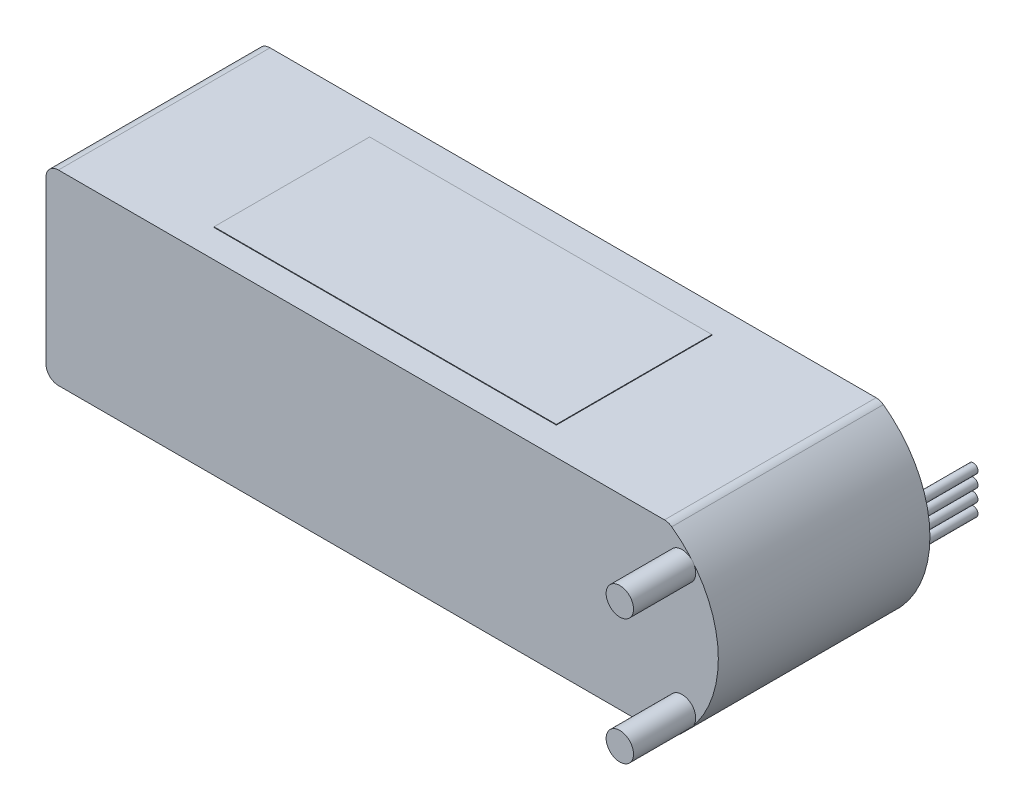
ISO-10303-21;
HEADER;
FILE_DESCRIPTION(('STEP AP214'),'2;1');
FILE_NAME('part.step','',(''),(''),'','','');
FILE_SCHEMA(('AUTOMOTIVE_DESIGN { 1 0 10303 214 1 1 1 1 }'));
ENDSEC;
DATA;
#1=APPLICATION_CONTEXT('core data for automotive mechanical design processes');
#2=APPLICATION_PROTOCOL_DEFINITION('international standard','automotive_design',2000,#1);
#3=PRODUCT_CONTEXT('',#1,'mechanical');
#4=PRODUCT('Part','Part','',(#3));
#5=PRODUCT_RELATED_PRODUCT_CATEGORY('part','',(#4));
#6=PRODUCT_DEFINITION_FORMATION('','',#4);
#7=PRODUCT_DEFINITION_CONTEXT('part definition',#1,'design');
#8=PRODUCT_DEFINITION('design','',#6,#7);
#9=PRODUCT_DEFINITION_SHAPE('','',#8);
#10=(LENGTH_UNIT() NAMED_UNIT(*) SI_UNIT(.MILLI.,.METRE.));
#11=(NAMED_UNIT(*) PLANE_ANGLE_UNIT() SI_UNIT($,.RADIAN.));
#12=(NAMED_UNIT(*) SI_UNIT($,.STERADIAN.) SOLID_ANGLE_UNIT());
#13=UNCERTAINTY_MEASURE_WITH_UNIT(LENGTH_MEASURE(1.E-05),#10,'distance_accuracy_value','');
#14=(GEOMETRIC_REPRESENTATION_CONTEXT(3) GLOBAL_UNCERTAINTY_ASSIGNED_CONTEXT((#13)) GLOBAL_UNIT_ASSIGNED_CONTEXT((#10,
#11,#12)) REPRESENTATION_CONTEXT('',''));
#15=CARTESIAN_POINT('',(0.,0.,0.));
#16=DIRECTION('',(0.,0.,1.));
#17=DIRECTION('',(1.,0.,0.));
#18=AXIS2_PLACEMENT_3D('',#15,#16,#17);
#19=CARTESIAN_POINT('',(55.,-3.00000000000001,-27.));
#20=DIRECTION('',(0.,0.,1.));
#21=DIRECTION('',(1.,0.,0.));
#22=AXIS2_PLACEMENT_3D('',#19,#20,#21);
#23=CYLINDRICAL_SURFACE('',#22,0.749999999999999);
#24=CARTESIAN_POINT('',(55.,-3.00000000000001,-27.));
#25=DIRECTION('',(0.,0.,-1.));
#26=DIRECTION('',(1.,0.,0.));
#27=AXIS2_PLACEMENT_3D('',#24,#25,#26);
#28=CIRCLE('',#27,0.749999999999999);
#29=CARTESIAN_POINT('',(55.75,-3.00000000000001,-27.));
#30=VERTEX_POINT('',#29);
#31=EDGE_CURVE('E11',#30,#30,#28,.T.);
#32=ORIENTED_EDGE('',*,*,#31,.F.);
#33=EDGE_LOOP('',(#32));
#34=FACE_BOUND('',#33,.T.);
#35=CARTESIAN_POINT('',(55.,-3.00000000000001,-17.));
#36=DIRECTION('',(0.,0.,-1.));
#37=DIRECTION('',(1.,0.,0.));
#38=AXIS2_PLACEMENT_3D('',#35,#36,#37);
#39=CIRCLE('',#38,0.749999999999999);
#40=CARTESIAN_POINT('',(55.75,-3.00000000000001,-17.));
#41=VERTEX_POINT('',#40);
#42=EDGE_CURVE('E48',#41,#41,#39,.T.);
#43=ORIENTED_EDGE('',*,*,#42,.T.);
#44=EDGE_LOOP('',(#43));
#45=FACE_BOUND('',#44,.T.);
#46=ADVANCED_FACE('F45',(#34,#45),#23,.T.);
#47=CARTESIAN_POINT('',(55.,-3.00000000000001,-27.));
#48=DIRECTION('',(0.,0.,1.));
#49=DIRECTION('',(1.,0.,0.));
#50=AXIS2_PLACEMENT_3D('',#47,#48,#49);
#51=PLANE('',#50);
#52=ORIENTED_EDGE('',*,*,#31,.T.);
#53=EDGE_LOOP('',(#52));
#54=FACE_BOUND('',#53,.T.);
#55=ADVANCED_FACE('F60',(#54),#51,.F.);
#56=CARTESIAN_POINT('',(55.,-3.00000000000001,-17.));
#57=DIRECTION('',(0.,0.,1.));
#58=DIRECTION('',(1.,0.,0.));
#59=AXIS2_PLACEMENT_3D('',#56,#57,#58);
#60=PLANE('',#59);
#61=ORIENTED_EDGE('',*,*,#42,.F.);
#62=EDGE_LOOP('',(#61));
#63=FACE_BOUND('',#62,.T.);
#64=ADVANCED_FACE('F58',(#63),#60,.T.);
#65=CLOSED_SHELL('',(#46,#55,#64));
#66=MANIFOLD_SOLID_BREP('B2',#65);
#67=CARTESIAN_POINT('',(55.,0.999999999999992,-27.));
#68=DIRECTION('',(0.,0.,1.));
#69=DIRECTION('',(1.,0.,0.));
#70=AXIS2_PLACEMENT_3D('',#67,#68,#69);
#71=CYLINDRICAL_SURFACE('',#70,0.749999999999999);
#72=CARTESIAN_POINT('',(55.,0.999999999999992,-27.));
#73=DIRECTION('',(0.,0.,-1.));
#74=DIRECTION('',(-1.,0.,0.));
#75=AXIS2_PLACEMENT_3D('',#72,#73,#74);
#76=CIRCLE('',#75,0.749999999999999);
#77=CARTESIAN_POINT('',(54.25,0.999999999999992,-27.));
#78=VERTEX_POINT('',#77);
#79=EDGE_CURVE('E44',#78,#78,#76,.T.);
#80=ORIENTED_EDGE('',*,*,#79,.F.);
#81=EDGE_LOOP('',(#80));
#82=FACE_BOUND('',#81,.T.);
#83=CARTESIAN_POINT('',(55.,0.999999999999992,-17.));
#84=DIRECTION('',(0.,0.,-1.));
#85=DIRECTION('',(-1.,0.,0.));
#86=AXIS2_PLACEMENT_3D('',#83,#84,#85);
#87=CIRCLE('',#86,0.749999999999999);
#88=CARTESIAN_POINT('',(54.25,0.999999999999992,-17.));
#89=VERTEX_POINT('',#88);
#90=EDGE_CURVE('E117',#89,#89,#87,.T.);
#91=ORIENTED_EDGE('',*,*,#90,.T.);
#92=EDGE_LOOP('',(#91));
#93=FACE_BOUND('',#92,.T.);
#94=ADVANCED_FACE('F114',(#82,#93),#71,.T.);
#95=CARTESIAN_POINT('',(55.,0.999999999999992,-27.));
#96=DIRECTION('',(0.,0.,-1.));
#97=DIRECTION('',(-1.,0.,0.));
#98=AXIS2_PLACEMENT_3D('',#95,#96,#97);
#99=PLANE('',#98);
#100=ORIENTED_EDGE('',*,*,#79,.T.);
#101=EDGE_LOOP('',(#100));
#102=FACE_BOUND('',#101,.T.);
#103=ADVANCED_FACE('F129',(#102),#99,.T.);
#104=CARTESIAN_POINT('',(55.,0.999999999999992,-17.));
#105=DIRECTION('',(0.,0.,-1.));
#106=DIRECTION('',(-1.,0.,0.));
#107=AXIS2_PLACEMENT_3D('',#104,#105,#106);
#108=PLANE('',#107);
#109=ORIENTED_EDGE('',*,*,#90,.F.);
#110=EDGE_LOOP('',(#109));
#111=FACE_BOUND('',#110,.T.);
#112=ADVANCED_FACE('F127',(#111),#108,.F.);
#113=CLOSED_SHELL('',(#94,#103,#112));
#114=MANIFOLD_SOLID_BREP('B6',#113);
#115=CARTESIAN_POINT('',(55.,-1.00000000000001,-27.));
#116=DIRECTION('',(0.,0.,1.));
#117=DIRECTION('',(1.,0.,0.));
#118=AXIS2_PLACEMENT_3D('',#115,#116,#117);
#119=CYLINDRICAL_SURFACE('',#118,0.749999999999999);
#120=CARTESIAN_POINT('',(55.,-1.00000000000001,-27.));
#121=DIRECTION('',(0.,0.,-1.));
#122=DIRECTION('',(1.,0.,0.));
#123=AXIS2_PLACEMENT_3D('',#120,#121,#122);
#124=CIRCLE('',#123,0.749999999999999);
#125=CARTESIAN_POINT('',(55.75,-1.00000000000001,-27.));
#126=VERTEX_POINT('',#125);
#127=EDGE_CURVE('E113',#126,#126,#124,.T.);
#128=ORIENTED_EDGE('',*,*,#127,.F.);
#129=EDGE_LOOP('',(#128));
#130=FACE_BOUND('',#129,.T.);
#131=CARTESIAN_POINT('',(55.,-1.00000000000001,-17.));
#132=DIRECTION('',(0.,0.,-1.));
#133=DIRECTION('',(1.,0.,0.));
#134=AXIS2_PLACEMENT_3D('',#131,#132,#133);
#135=CIRCLE('',#134,0.749999999999999);
#136=CARTESIAN_POINT('',(55.75,-1.00000000000001,-17.));
#137=VERTEX_POINT('',#136);
#138=EDGE_CURVE('E186',#137,#137,#135,.T.);
#139=ORIENTED_EDGE('',*,*,#138,.T.);
#140=EDGE_LOOP('',(#139));
#141=FACE_BOUND('',#140,.T.);
#142=ADVANCED_FACE('F183',(#130,#141),#119,.T.);
#143=CARTESIAN_POINT('',(55.,-1.00000000000001,-27.));
#144=DIRECTION('',(0.,0.,1.));
#145=DIRECTION('',(1.,0.,0.));
#146=AXIS2_PLACEMENT_3D('',#143,#144,#145);
#147=PLANE('',#146);
#148=ORIENTED_EDGE('',*,*,#127,.T.);
#149=EDGE_LOOP('',(#148));
#150=FACE_BOUND('',#149,.T.);
#151=ADVANCED_FACE('F198',(#150),#147,.F.);
#152=CARTESIAN_POINT('',(55.,-1.00000000000001,-17.));
#153=DIRECTION('',(0.,0.,1.));
#154=DIRECTION('',(1.,0.,0.));
#155=AXIS2_PLACEMENT_3D('',#152,#153,#154);
#156=PLANE('',#155);
#157=ORIENTED_EDGE('',*,*,#138,.F.);
#158=EDGE_LOOP('',(#157));
#159=FACE_BOUND('',#158,.T.);
#160=ADVANCED_FACE('F196',(#159),#156,.T.);
#161=CLOSED_SHELL('',(#142,#151,#160));
#162=MANIFOLD_SOLID_BREP('B39',#161);
#163=CARTESIAN_POINT('',(55.,2.99999999999999,-27.));
#164=DIRECTION('',(0.,0.,1.));
#165=DIRECTION('',(1.,0.,0.));
#166=AXIS2_PLACEMENT_3D('',#163,#164,#165);
#167=CYLINDRICAL_SURFACE('',#166,0.749999999999999);
#168=CARTESIAN_POINT('',(55.,2.99999999999999,-27.));
#169=DIRECTION('',(0.,0.,-1.));
#170=DIRECTION('',(-1.,0.,0.));
#171=AXIS2_PLACEMENT_3D('',#168,#169,#170);
#172=CIRCLE('',#171,0.749999999999999);
#173=CARTESIAN_POINT('',(54.25,2.99999999999999,-27.));
#174=VERTEX_POINT('',#173);
#175=EDGE_CURVE('E182',#174,#174,#172,.T.);
#176=ORIENTED_EDGE('',*,*,#175,.F.);
#177=EDGE_LOOP('',(#176));
#178=FACE_BOUND('',#177,.T.);
#179=CARTESIAN_POINT('',(55.,2.99999999999999,-17.));
#180=DIRECTION('',(0.,0.,-1.));
#181=DIRECTION('',(-1.,0.,0.));
#182=AXIS2_PLACEMENT_3D('',#179,#180,#181);
#183=CIRCLE('',#182,0.749999999999999);
#184=CARTESIAN_POINT('',(54.25,2.99999999999999,-17.));
#185=VERTEX_POINT('',#184);
#186=EDGE_CURVE('E255',#185,#185,#183,.T.);
#187=ORIENTED_EDGE('',*,*,#186,.T.);
#188=EDGE_LOOP('',(#187));
#189=FACE_BOUND('',#188,.T.);
#190=ADVANCED_FACE('F252',(#178,#189),#167,.T.);
#191=CARTESIAN_POINT('',(55.,2.99999999999999,-27.));
#192=DIRECTION('',(0.,0.,-1.));
#193=DIRECTION('',(-1.,0.,0.));
#194=AXIS2_PLACEMENT_3D('',#191,#192,#193);
#195=PLANE('',#194);
#196=ORIENTED_EDGE('',*,*,#175,.T.);
#197=EDGE_LOOP('',(#196));
#198=FACE_BOUND('',#197,.T.);
#199=ADVANCED_FACE('F267',(#198),#195,.T.);
#200=CARTESIAN_POINT('',(55.,2.99999999999999,-17.));
#201=DIRECTION('',(0.,0.,-1.));
#202=DIRECTION('',(-1.,0.,0.));
#203=AXIS2_PLACEMENT_3D('',#200,#201,#202);
#204=PLANE('',#203);
#205=ORIENTED_EDGE('',*,*,#186,.F.);
#206=EDGE_LOOP('',(#205));
#207=FACE_BOUND('',#206,.T.);
#208=ADVANCED_FACE('F265',(#207),#204,.F.);
#209=CLOSED_SHELL('',(#190,#199,#208));
#210=MANIFOLD_SOLID_BREP('B108',#209);
#211=CARTESIAN_POINT('',(52.2,-10.0835446118809,27.));
#212=DIRECTION('',(0.,0.,-1.));
#213=DIRECTION('',(-1.,0.,0.));
#214=AXIS2_PLACEMENT_3D('',#211,#212,#213);
#215=CYLINDRICAL_SURFACE('',#214,2.2);
#216=CARTESIAN_POINT('',(52.2,-10.0835446118809,27.));
#217=DIRECTION('',(0.,0.,1.));
#218=DIRECTION('',(-1.,0.,0.));
#219=AXIS2_PLACEMENT_3D('',#216,#217,#218);
#220=CIRCLE('',#219,2.2);
#221=CARTESIAN_POINT('',(50.,-10.0835446118809,27.));
#222=VERTEX_POINT('',#221);
#223=EDGE_CURVE('E251',#222,#222,#220,.T.);
#224=ORIENTED_EDGE('',*,*,#223,.F.);
#225=EDGE_LOOP('',(#224));
#226=FACE_BOUND('',#225,.T.);
#227=CARTESIAN_POINT('',(52.2,-10.0835446118809,17.));
#228=DIRECTION('',(0.,0.,1.));
#229=DIRECTION('',(-1.,0.,0.));
#230=AXIS2_PLACEMENT_3D('',#227,#228,#229);
#231=CIRCLE('',#230,2.2);
#232=CARTESIAN_POINT('',(50.,-10.0835446118809,17.));
#233=VERTEX_POINT('',#232);
#234=EDGE_CURVE('E324',#233,#233,#231,.T.);
#235=ORIENTED_EDGE('',*,*,#234,.T.);
#236=EDGE_LOOP('',(#235));
#237=FACE_BOUND('',#236,.T.);
#238=ADVANCED_FACE('F321',(#226,#237),#215,.T.);
#239=CARTESIAN_POINT('',(52.2,-10.0835446118809,27.));
#240=DIRECTION('',(0.,0.,-1.));
#241=DIRECTION('',(-1.,0.,0.));
#242=AXIS2_PLACEMENT_3D('',#239,#240,#241);
#243=PLANE('',#242);
#244=ORIENTED_EDGE('',*,*,#223,.T.);
#245=EDGE_LOOP('',(#244));
#246=FACE_BOUND('',#245,.T.);
#247=ADVANCED_FACE('F336',(#246),#243,.F.);
#248=CARTESIAN_POINT('',(52.2,-10.0835446118809,17.));
#249=DIRECTION('',(0.,0.,-1.));
#250=DIRECTION('',(-1.,0.,0.));
#251=AXIS2_PLACEMENT_3D('',#248,#249,#250);
#252=PLANE('',#251);
#253=ORIENTED_EDGE('',*,*,#234,.F.);
#254=EDGE_LOOP('',(#253));
#255=FACE_BOUND('',#254,.T.);
#256=ADVANCED_FACE('F334',(#255),#252,.T.);
#257=CLOSED_SHELL('',(#238,#247,#256));
#258=MANIFOLD_SOLID_BREP('B177',#257);
#259=CARTESIAN_POINT('',(52.2,10.0835446118809,27.));
#260=DIRECTION('',(0.,0.,-1.));
#261=DIRECTION('',(-1.,0.,0.));
#262=AXIS2_PLACEMENT_3D('',#259,#260,#261);
#263=CYLINDRICAL_SURFACE('',#262,2.2);
#264=CARTESIAN_POINT('',(52.2,10.0835446118809,27.));
#265=DIRECTION('',(0.,0.,1.));
#266=DIRECTION('',(1.,0.,0.));
#267=AXIS2_PLACEMENT_3D('',#264,#265,#266);
#268=CIRCLE('',#267,2.2);
#269=CARTESIAN_POINT('',(54.4,10.0835446118809,27.));
#270=VERTEX_POINT('',#269);
#271=EDGE_CURVE('E320',#270,#270,#268,.T.);
#272=ORIENTED_EDGE('',*,*,#271,.F.);
#273=EDGE_LOOP('',(#272));
#274=FACE_BOUND('',#273,.T.);
#275=CARTESIAN_POINT('',(52.2,10.0835446118809,17.));
#276=DIRECTION('',(0.,0.,1.));
#277=DIRECTION('',(1.,0.,0.));
#278=AXIS2_PLACEMENT_3D('',#275,#276,#277);
#279=CIRCLE('',#278,2.2);
#280=CARTESIAN_POINT('',(54.4,10.0835446118809,17.));
#281=VERTEX_POINT('',#280);
#282=EDGE_CURVE('E394',#281,#281,#279,.T.);
#283=ORIENTED_EDGE('',*,*,#282,.T.);
#284=EDGE_LOOP('',(#283));
#285=FACE_BOUND('',#284,.T.);
#286=ADVANCED_FACE('F391',(#274,#285),#263,.T.);
#287=CARTESIAN_POINT('',(52.2,10.0835446118809,27.));
#288=DIRECTION('',(0.,0.,1.));
#289=DIRECTION('',(1.,0.,0.));
#290=AXIS2_PLACEMENT_3D('',#287,#288,#289);
#291=PLANE('',#290);
#292=ORIENTED_EDGE('',*,*,#271,.T.);
#293=EDGE_LOOP('',(#292));
#294=FACE_BOUND('',#293,.T.);
#295=ADVANCED_FACE('F406',(#294),#291,.T.);
#296=CARTESIAN_POINT('',(52.2,10.0835446118809,17.));
#297=DIRECTION('',(0.,0.,1.));
#298=DIRECTION('',(1.,0.,0.));
#299=AXIS2_PLACEMENT_3D('',#296,#297,#298);
#300=PLANE('',#299);
#301=ORIENTED_EDGE('',*,*,#282,.F.);
#302=EDGE_LOOP('',(#301));
#303=FACE_BOUND('',#302,.T.);
#304=ADVANCED_FACE('F404',(#303),#300,.F.);
#305=CLOSED_SHELL('',(#286,#295,#304));
#306=MANIFOLD_SOLID_BREP('B246',#305);
#307=CARTESIAN_POINT('',(-50.,15.,17.));
#308=DIRECTION('',(0.,-1.,0.));
#309=DIRECTION('',(0.,0.,-1.));
#310=AXIS2_PLACEMENT_3D('',#307,#308,#309);
#311=PLANE('',#310);
#312=DIRECTION('',(-1.,0.,0.));
#313=VECTOR('',#312,1.);
#314=CARTESIAN_POINT('',(-50.,15.,17.));
#315=LINE('',#314,#313);
#316=CARTESIAN_POINT('',(49.3749119724252,15.,17.));
#317=VERTEX_POINT('',#316);
#318=CARTESIAN_POINT('',(-48.,15.,17.));
#319=VERTEX_POINT('',#318);
#320=EDGE_CURVE('E578',#317,#319,#315,.T.);
#321=ORIENTED_EDGE('',*,*,#320,.F.);
#322=DIRECTION('',(0.,0.,-1.));
#323=VECTOR('',#322,1.);
#324=CARTESIAN_POINT('',(49.3749119724252,15.,17.));
#325=LINE('',#324,#323);
#326=CARTESIAN_POINT('',(49.3749119724252,15.,-17.));
#327=VERTEX_POINT('',#326);
#328=EDGE_CURVE('E619',#317,#327,#325,.T.);
#329=ORIENTED_EDGE('',*,*,#328,.T.);
#330=DIRECTION('',(-1.,0.,0.));
#331=VECTOR('',#330,1.);
#332=CARTESIAN_POINT('',(-50.,15.,-17.));
#333=LINE('',#332,#331);
#334=CARTESIAN_POINT('',(-48.,15.,-17.));
#335=VERTEX_POINT('',#334);
#336=EDGE_CURVE('E569',#327,#335,#333,.T.);
#337=ORIENTED_EDGE('',*,*,#336,.T.);
#338=DIRECTION('',(0.,0.,-1.));
#339=VECTOR('',#338,1.);
#340=CARTESIAN_POINT('',(-48.,15.,17.));
#341=LINE('',#340,#339);
#342=EDGE_CURVE('E617',#335,#319,#341,.F.);
#343=ORIENTED_EDGE('',*,*,#342,.T.);
#344=EDGE_LOOP('',(#321,#329,#337,#343));
#345=FACE_BOUND('',#344,.T.);
#346=DIRECTION('',(0.,0.,-1.));
#347=VECTOR('',#346,1.);
#348=CARTESIAN_POINT('',(27.5,15.,-12.5));
#349=LINE('',#348,#347);
#350=CARTESIAN_POINT('',(27.5,15.,12.5));
#351=VERTEX_POINT('',#350);
#352=CARTESIAN_POINT('',(27.5,15.,-12.5));
#353=VERTEX_POINT('',#352);
#354=EDGE_CURVE('E565',#351,#353,#349,.T.);
#355=ORIENTED_EDGE('',*,*,#354,.F.);
#356=DIRECTION('',(1.,0.,0.));
#357=VECTOR('',#356,1.);
#358=CARTESIAN_POINT('',(-27.5,15.,12.5));
#359=LINE('',#358,#357);
#360=CARTESIAN_POINT('',(-27.5,15.,12.5));
#361=VERTEX_POINT('',#360);
#362=EDGE_CURVE('E562',#361,#351,#359,.T.);
#363=ORIENTED_EDGE('',*,*,#362,.F.);
#364=DIRECTION('',(0.,0.,1.));
#365=VECTOR('',#364,1.);
#366=CARTESIAN_POINT('',(-27.5,15.,-12.5));
#367=LINE('',#366,#365);
#368=CARTESIAN_POINT('',(-27.5,15.,-12.5));
#369=VERTEX_POINT('',#368);
#370=EDGE_CURVE('E810',#369,#361,#367,.T.);
#371=ORIENTED_EDGE('',*,*,#370,.F.);
#372=DIRECTION('',(-1.,0.,0.));
#373=VECTOR('',#372,1.);
#374=CARTESIAN_POINT('',(-27.5,15.,-12.5));
#375=LINE('',#374,#373);
#376=EDGE_CURVE('E812',#353,#369,#375,.T.);
#377=ORIENTED_EDGE('',*,*,#376,.F.);
#378=EDGE_LOOP('',(#355,#363,#371,#377));
#379=FACE_BOUND('',#378,.T.);
#380=ADVANCED_FACE('F452',(#345,#379),#311,.F.);
#381=CARTESIAN_POINT('',(40.,0.,17.));
#382=DIRECTION('',(0.,0.,-1.));
#383=DIRECTION('',(-1.,0.,0.));
#384=AXIS2_PLACEMENT_3D('',#381,#382,#383);
#385=CYLINDRICAL_SURFACE('',#384,18.02775637732);
#386=CARTESIAN_POINT('',(40.,0.,17.));
#387=DIRECTION('',(0.,0.,1.));
#388=DIRECTION('',(1.,0.,0.));
#389=AXIS2_PLACEMENT_3D('',#386,#387,#388);
#390=CIRCLE('',#389,18.02775637732);
#391=CARTESIAN_POINT('',(50.5447465708211,-14.6221858747985,17.));
#392=VERTEX_POINT('',#391);
#393=CARTESIAN_POINT('',(50.5447465708211,14.6221858747985,17.));
#394=VERTEX_POINT('',#393);
#395=EDGE_CURVE('E575',#392,#394,#390,.T.);
#396=ORIENTED_EDGE('',*,*,#395,.F.);
#397=DIRECTION('',(0.,0.,-1.));
#398=VECTOR('',#397,1.);
#399=CARTESIAN_POINT('',(50.5447465708211,-14.6221858747985,17.));
#400=LINE('',#399,#398);
#401=CARTESIAN_POINT('',(50.5447465708211,-14.6221858747985,-17.));
#402=VERTEX_POINT('',#401);
#403=EDGE_CURVE('E594',#392,#402,#400,.T.);
#404=ORIENTED_EDGE('',*,*,#403,.T.);
#405=CARTESIAN_POINT('',(40.,0.,-17.));
#406=DIRECTION('',(0.,0.,1.));
#407=DIRECTION('',(1.,0.,0.));
#408=AXIS2_PLACEMENT_3D('',#405,#406,#407);
#409=CIRCLE('',#408,18.02775637732);
#410=CARTESIAN_POINT('',(50.5447465708211,14.6221858747985,-17.));
#411=VERTEX_POINT('',#410);
#412=EDGE_CURVE('E566',#402,#411,#409,.T.);
#413=ORIENTED_EDGE('',*,*,#412,.T.);
#414=DIRECTION('',(0.,0.,-1.));
#415=VECTOR('',#414,1.);
#416=CARTESIAN_POINT('',(50.5447465708211,14.6221858747985,17.));
#417=LINE('',#416,#415);
#418=EDGE_CURVE('E585',#411,#394,#417,.F.);
#419=ORIENTED_EDGE('',*,*,#418,.T.);
#420=EDGE_LOOP('',(#396,#404,#413,#419));
#421=FACE_BOUND('',#420,.T.);
#422=ADVANCED_FACE('F646',(#421),#385,.T.);
#423=CARTESIAN_POINT('',(-50.,15.,17.));
#424=DIRECTION('',(1.,0.,0.));
#425=DIRECTION('',(0.,1.,0.));
#426=AXIS2_PLACEMENT_3D('',#423,#424,#425);
#427=PLANE('',#426);
#428=DIRECTION('',(0.,-1.,0.));
#429=VECTOR('',#428,1.);
#430=CARTESIAN_POINT('',(-50.,15.,-17.));
#431=LINE('',#430,#429);
#432=CARTESIAN_POINT('',(-50.,13.,-17.));
#433=VERTEX_POINT('',#432);
#434=CARTESIAN_POINT('',(-50.,-13.,-17.));
#435=VERTEX_POINT('',#434);
#436=EDGE_CURVE('E589',#433,#435,#431,.T.);
#437=ORIENTED_EDGE('',*,*,#436,.T.);
#438=DIRECTION('',(0.,0.,-1.));
#439=VECTOR('',#438,1.);
#440=CARTESIAN_POINT('',(-50.,-13.,17.));
#441=LINE('',#440,#439);
#442=CARTESIAN_POINT('',(-50.,-13.,17.));
#443=VERTEX_POINT('',#442);
#444=EDGE_CURVE('E389',#435,#443,#441,.F.);
#445=ORIENTED_EDGE('',*,*,#444,.T.);
#446=DIRECTION('',(0.,-1.,0.));
#447=VECTOR('',#446,1.);
#448=CARTESIAN_POINT('',(-50.,15.,17.));
#449=LINE('',#448,#447);
#450=CARTESIAN_POINT('',(-50.,13.,17.));
#451=VERTEX_POINT('',#450);
#452=EDGE_CURVE('E581',#451,#443,#449,.T.);
#453=ORIENTED_EDGE('',*,*,#452,.F.);
#454=DIRECTION('',(0.,0.,-1.));
#455=VECTOR('',#454,1.);
#456=CARTESIAN_POINT('',(-50.,13.,17.));
#457=LINE('',#456,#455);
#458=EDGE_CURVE('E460',#451,#433,#457,.T.);
#459=ORIENTED_EDGE('',*,*,#458,.T.);
#460=EDGE_LOOP('',(#437,#445,#453,#459));
#461=FACE_BOUND('',#460,.T.);
#462=ADVANCED_FACE('F624',(#461),#427,.F.);
#463=CARTESIAN_POINT('',(-50.,-15.,17.));
#464=DIRECTION('',(0.,1.,0.));
#465=DIRECTION('',(0.,0.,1.));
#466=AXIS2_PLACEMENT_3D('',#463,#464,#465);
#467=PLANE('',#466);
#468=DIRECTION('',(1.,0.,0.));
#469=VECTOR('',#468,1.);
#470=CARTESIAN_POINT('',(-50.,-15.,-17.));
#471=LINE('',#470,#469);
#472=CARTESIAN_POINT('',(-48.,-15.,-17.));
#473=VERTEX_POINT('',#472);
#474=CARTESIAN_POINT('',(49.3749119724252,-15.,-17.));
#475=VERTEX_POINT('',#474);
#476=EDGE_CURVE('E579',#473,#475,#471,.T.);
#477=ORIENTED_EDGE('',*,*,#476,.T.);
#478=DIRECTION('',(0.,0.,-1.));
#479=VECTOR('',#478,1.);
#480=CARTESIAN_POINT('',(49.3749119724252,-15.,17.));
#481=LINE('',#480,#479);
#482=CARTESIAN_POINT('',(49.3749119724252,-15.,17.));
#483=VERTEX_POINT('',#482);
#484=EDGE_CURVE('E608',#475,#483,#481,.F.);
#485=ORIENTED_EDGE('',*,*,#484,.T.);
#486=DIRECTION('',(1.,0.,0.));
#487=VECTOR('',#486,1.);
#488=CARTESIAN_POINT('',(-50.,-15.,17.));
#489=LINE('',#488,#487);
#490=CARTESIAN_POINT('',(-48.,-15.,17.));
#491=VERTEX_POINT('',#490);
#492=EDGE_CURVE('E583',#491,#483,#489,.T.);
#493=ORIENTED_EDGE('',*,*,#492,.F.);
#494=DIRECTION('',(0.,0.,-1.));
#495=VECTOR('',#494,1.);
#496=CARTESIAN_POINT('',(-48.,-15.,17.));
#497=LINE('',#496,#495);
#498=EDGE_CURVE('E605',#491,#473,#497,.T.);
#499=ORIENTED_EDGE('',*,*,#498,.T.);
#500=EDGE_LOOP('',(#477,#485,#493,#499));
#501=FACE_BOUND('',#500,.T.);
#502=ADVANCED_FACE('F637',(#501),#467,.F.);
#503=CARTESIAN_POINT('',(40.,0.,17.));
#504=DIRECTION('',(0.,0.,1.));
#505=DIRECTION('',(1.,0.,0.));
#506=AXIS2_PLACEMENT_3D('',#503,#504,#505);
#507=PLANE('',#506);
#508=ORIENTED_EDGE('',*,*,#492,.T.);
#509=CARTESIAN_POINT('',(49.3749119724252,-13.,17.));
#510=DIRECTION('',(0.,0.,1.));
#511=DIRECTION('',(1.,0.,0.));
#512=AXIS2_PLACEMENT_3D('',#509,#510,#511);
#513=CIRCLE('',#512,2.);
#514=EDGE_CURVE('E615',#483,#392,#513,.T.);
#515=ORIENTED_EDGE('',*,*,#514,.T.);
#516=ORIENTED_EDGE('',*,*,#395,.T.);
#517=CARTESIAN_POINT('',(49.3749119724252,13.,17.));
#518=DIRECTION('',(0.,0.,1.));
#519=DIRECTION('',(1.,0.,0.));
#520=AXIS2_PLACEMENT_3D('',#517,#518,#519);
#521=CIRCLE('',#520,2.);
#522=EDGE_CURVE('E613',#394,#317,#521,.T.);
#523=ORIENTED_EDGE('',*,*,#522,.T.);
#524=ORIENTED_EDGE('',*,*,#320,.T.);
#525=CARTESIAN_POINT('',(-48.,13.,17.));
#526=DIRECTION('',(0.,0.,1.));
#527=DIRECTION('',(1.,0.,0.));
#528=AXIS2_PLACEMENT_3D('',#525,#526,#527);
#529=CIRCLE('',#528,2.);
#530=EDGE_CURVE('E472',#319,#451,#529,.T.);
#531=ORIENTED_EDGE('',*,*,#530,.T.);
#532=ORIENTED_EDGE('',*,*,#452,.T.);
#533=CARTESIAN_POINT('',(-48.,-13.,17.));
#534=DIRECTION('',(0.,0.,1.));
#535=DIRECTION('',(1.,0.,0.));
#536=AXIS2_PLACEMENT_3D('',#533,#534,#535);
#537=CIRCLE('',#536,2.);
#538=EDGE_CURVE('E611',#443,#491,#537,.T.);
#539=ORIENTED_EDGE('',*,*,#538,.T.);
#540=EDGE_LOOP('',(#508,#515,#516,#523,#524,#531,#532,#539));
#541=FACE_BOUND('',#540,.T.);
#542=ADVANCED_FACE('F640',(#541),#507,.T.);
#543=CARTESIAN_POINT('',(40.,0.,-17.));
#544=DIRECTION('',(0.,0.,1.));
#545=DIRECTION('',(1.,0.,0.));
#546=AXIS2_PLACEMENT_3D('',#543,#544,#545);
#547=PLANE('',#546);
#548=ORIENTED_EDGE('',*,*,#412,.F.);
#549=CARTESIAN_POINT('',(49.3749119724252,-13.,-17.));
#550=DIRECTION('',(0.,0.,1.));
#551=DIRECTION('',(1.,0.,0.));
#552=AXIS2_PLACEMENT_3D('',#549,#550,#551);
#553=CIRCLE('',#552,2.);
#554=EDGE_CURVE('E603',#402,#475,#553,.F.);
#555=ORIENTED_EDGE('',*,*,#554,.T.);
#556=ORIENTED_EDGE('',*,*,#476,.F.);
#557=CARTESIAN_POINT('',(-48.,-13.,-17.));
#558=DIRECTION('',(0.,0.,1.));
#559=DIRECTION('',(1.,0.,0.));
#560=AXIS2_PLACEMENT_3D('',#557,#558,#559);
#561=CIRCLE('',#560,2.);
#562=EDGE_CURVE('E599',#473,#435,#561,.F.);
#563=ORIENTED_EDGE('',*,*,#562,.T.);
#564=ORIENTED_EDGE('',*,*,#436,.F.);
#565=CARTESIAN_POINT('',(-48.,13.,-17.));
#566=DIRECTION('',(0.,0.,1.));
#567=DIRECTION('',(1.,0.,0.));
#568=AXIS2_PLACEMENT_3D('',#565,#566,#567);
#569=CIRCLE('',#568,2.);
#570=EDGE_CURVE('E597',#433,#335,#569,.F.);
#571=ORIENTED_EDGE('',*,*,#570,.T.);
#572=ORIENTED_EDGE('',*,*,#336,.F.);
#573=CARTESIAN_POINT('',(49.3749119724252,13.,-17.));
#574=DIRECTION('',(0.,0.,1.));
#575=DIRECTION('',(1.,0.,0.));
#576=AXIS2_PLACEMENT_3D('',#573,#574,#575);
#577=CIRCLE('',#576,2.);
#578=EDGE_CURVE('E601',#327,#411,#577,.F.);
#579=ORIENTED_EDGE('',*,*,#578,.T.);
#580=EDGE_LOOP('',(#548,#555,#556,#563,#564,#571,#572,#579));
#581=FACE_BOUND('',#580,.T.);
#582=ADVANCED_FACE('F628',(#581),#547,.F.);
#583=CARTESIAN_POINT('',(27.5,15.1,-12.5));
#584=DIRECTION('',(-1.,0.,0.));
#585=DIRECTION('',(0.,0.,1.));
#586=AXIS2_PLACEMENT_3D('',#583,#584,#585);
#587=PLANE('',#586);
#588=ORIENTED_EDGE('',*,*,#354,.T.);
#589=DIRECTION('',(0.,-1.,0.));
#590=VECTOR('',#589,1.);
#591=CARTESIAN_POINT('',(27.5,15.1,-12.5));
#592=LINE('',#591,#590);
#593=CARTESIAN_POINT('',(27.5,15.1,-12.5));
#594=VERTEX_POINT('',#593);
#595=EDGE_CURVE('E546',#594,#353,#592,.T.);
#596=ORIENTED_EDGE('',*,*,#595,.F.);
#597=DIRECTION('',(0.,0.,-1.));
#598=VECTOR('',#597,1.);
#599=CARTESIAN_POINT('',(27.5,15.1,-12.5));
#600=LINE('',#599,#598);
#601=CARTESIAN_POINT('',(27.5,15.1,12.5));
#602=VERTEX_POINT('',#601);
#603=EDGE_CURVE('E553',#602,#594,#600,.T.);
#604=ORIENTED_EDGE('',*,*,#603,.F.);
#605=DIRECTION('',(0.,-1.,0.));
#606=VECTOR('',#605,1.);
#607=CARTESIAN_POINT('',(27.5,15.1,12.5));
#608=LINE('',#607,#606);
#609=EDGE_CURVE('E815',#602,#351,#608,.T.);
#610=ORIENTED_EDGE('',*,*,#609,.T.);
#611=EDGE_LOOP('',(#588,#596,#604,#610));
#612=FACE_BOUND('',#611,.T.);
#613=ADVANCED_FACE('F564',(#612),#587,.F.);
#614=CARTESIAN_POINT('',(-27.5,15.1,-12.5));
#615=DIRECTION('',(0.,0.,1.));
#616=DIRECTION('',(1.,0.,0.));
#617=AXIS2_PLACEMENT_3D('',#614,#615,#616);
#618=PLANE('',#617);
#619=ORIENTED_EDGE('',*,*,#376,.T.);
#620=DIRECTION('',(0.,-1.,0.));
#621=VECTOR('',#620,1.);
#622=CARTESIAN_POINT('',(-27.5,15.1,-12.5));
#623=LINE('',#622,#621);
#624=CARTESIAN_POINT('',(-27.5,15.1,-12.5));
#625=VERTEX_POINT('',#624);
#626=EDGE_CURVE('E549',#625,#369,#623,.T.);
#627=ORIENTED_EDGE('',*,*,#626,.F.);
#628=DIRECTION('',(-1.,0.,0.));
#629=VECTOR('',#628,1.);
#630=CARTESIAN_POINT('',(-27.5,15.1,-12.5));
#631=LINE('',#630,#629);
#632=EDGE_CURVE('E541',#594,#625,#631,.T.);
#633=ORIENTED_EDGE('',*,*,#632,.F.);
#634=ORIENTED_EDGE('',*,*,#595,.T.);
#635=EDGE_LOOP('',(#619,#627,#633,#634));
#636=FACE_BOUND('',#635,.T.);
#637=ADVANCED_FACE('F544',(#636),#618,.F.);
#638=CARTESIAN_POINT('',(-27.5,15.1,-12.5));
#639=DIRECTION('',(1.,0.,0.));
#640=DIRECTION('',(0.,0.,-1.));
#641=AXIS2_PLACEMENT_3D('',#638,#639,#640);
#642=PLANE('',#641);
#643=ORIENTED_EDGE('',*,*,#370,.T.);
#644=DIRECTION('',(0.,-1.,0.));
#645=VECTOR('',#644,1.);
#646=CARTESIAN_POINT('',(-27.5,15.1,12.5));
#647=LINE('',#646,#645);
#648=CARTESIAN_POINT('',(-27.5,15.1,12.5));
#649=VERTEX_POINT('',#648);
#650=EDGE_CURVE('E571',#649,#361,#647,.T.);
#651=ORIENTED_EDGE('',*,*,#650,.F.);
#652=DIRECTION('',(0.,0.,1.));
#653=VECTOR('',#652,1.);
#654=CARTESIAN_POINT('',(-27.5,15.1,-12.5));
#655=LINE('',#654,#653);
#656=EDGE_CURVE('E552',#625,#649,#655,.T.);
#657=ORIENTED_EDGE('',*,*,#656,.F.);
#658=ORIENTED_EDGE('',*,*,#626,.T.);
#659=EDGE_LOOP('',(#643,#651,#657,#658));
#660=FACE_BOUND('',#659,.T.);
#661=ADVANCED_FACE('F703',(#660),#642,.F.);
#662=CARTESIAN_POINT('',(-27.5,15.1,12.5));
#663=DIRECTION('',(0.,0.,-1.));
#664=DIRECTION('',(-1.,0.,0.));
#665=AXIS2_PLACEMENT_3D('',#662,#663,#664);
#666=PLANE('',#665);
#667=ORIENTED_EDGE('',*,*,#362,.T.);
#668=ORIENTED_EDGE('',*,*,#609,.F.);
#669=DIRECTION('',(1.,0.,0.));
#670=VECTOR('',#669,1.);
#671=CARTESIAN_POINT('',(-27.5,15.1,12.5));
#672=LINE('',#671,#670);
#673=EDGE_CURVE('E558',#649,#602,#672,.T.);
#674=ORIENTED_EDGE('',*,*,#673,.F.);
#675=ORIENTED_EDGE('',*,*,#650,.T.);
#676=EDGE_LOOP('',(#667,#668,#674,#675));
#677=FACE_BOUND('',#676,.T.);
#678=ADVANCED_FACE('F692',(#677),#666,.F.);
#679=CARTESIAN_POINT('',(0.,15.1,0.));
#680=DIRECTION('',(0.,1.,0.));
#681=DIRECTION('',(0.,0.,1.));
#682=AXIS2_PLACEMENT_3D('',#679,#680,#681);
#683=PLANE('',#682);
#684=ORIENTED_EDGE('',*,*,#603,.T.);
#685=ORIENTED_EDGE('',*,*,#632,.T.);
#686=ORIENTED_EDGE('',*,*,#656,.T.);
#687=ORIENTED_EDGE('',*,*,#673,.T.);
#688=EDGE_LOOP('',(#684,#685,#686,#687));
#689=FACE_BOUND('',#688,.T.);
#690=ADVANCED_FACE('F556',(#689),#683,.T.);
#691=CARTESIAN_POINT('',(49.3749119724252,-13.,17.));
#692=DIRECTION('',(0.,0.,-1.));
#693=DIRECTION('',(-1.,0.,0.));
#694=AXIS2_PLACEMENT_3D('',#691,#692,#693);
#695=CYLINDRICAL_SURFACE('',#694,2.);
#696=ORIENTED_EDGE('',*,*,#514,.F.);
#697=ORIENTED_EDGE('',*,*,#484,.F.);
#698=ORIENTED_EDGE('',*,*,#554,.F.);
#699=ORIENTED_EDGE('',*,*,#403,.F.);
#700=EDGE_LOOP('',(#696,#697,#698,#699));
#701=FACE_BOUND('',#700,.T.);
#702=ADVANCED_FACE('F644',(#701),#695,.T.);
#703=CARTESIAN_POINT('',(49.3749119724252,13.,17.));
#704=DIRECTION('',(0.,0.,-1.));
#705=DIRECTION('',(-1.,0.,0.));
#706=AXIS2_PLACEMENT_3D('',#703,#704,#705);
#707=CYLINDRICAL_SURFACE('',#706,2.);
#708=ORIENTED_EDGE('',*,*,#522,.F.);
#709=ORIENTED_EDGE('',*,*,#418,.F.);
#710=ORIENTED_EDGE('',*,*,#578,.F.);
#711=ORIENTED_EDGE('',*,*,#328,.F.);
#712=EDGE_LOOP('',(#708,#709,#710,#711));
#713=FACE_BOUND('',#712,.T.);
#714=ADVANCED_FACE('F651',(#713),#707,.T.);
#715=CARTESIAN_POINT('',(-48.,-13.,17.));
#716=DIRECTION('',(0.,0.,-1.));
#717=DIRECTION('',(-1.,0.,0.));
#718=AXIS2_PLACEMENT_3D('',#715,#716,#717);
#719=CYLINDRICAL_SURFACE('',#718,2.);
#720=ORIENTED_EDGE('',*,*,#538,.F.);
#721=ORIENTED_EDGE('',*,*,#444,.F.);
#722=ORIENTED_EDGE('',*,*,#562,.F.);
#723=ORIENTED_EDGE('',*,*,#498,.F.);
#724=EDGE_LOOP('',(#720,#721,#722,#723));
#725=FACE_BOUND('',#724,.T.);
#726=ADVANCED_FACE('F634',(#725),#719,.T.);
#727=CARTESIAN_POINT('',(-48.,13.,17.));
#728=DIRECTION('',(0.,0.,-1.));
#729=DIRECTION('',(-1.,0.,0.));
#730=AXIS2_PLACEMENT_3D('',#727,#728,#729);
#731=CYLINDRICAL_SURFACE('',#730,2.);
#732=ORIENTED_EDGE('',*,*,#530,.F.);
#733=ORIENTED_EDGE('',*,*,#342,.F.);
#734=ORIENTED_EDGE('',*,*,#570,.F.);
#735=ORIENTED_EDGE('',*,*,#458,.F.);
#736=EDGE_LOOP('',(#732,#733,#734,#735));
#737=FACE_BOUND('',#736,.T.);
#738=ADVANCED_FACE('F454',(#737),#731,.T.);
#739=CLOSED_SHELL('',(#380,#422,#462,#502,#542,#582,#613,#637,#661,#678,#690,#702,#714,#726,#738));
#740=MANIFOLD_SOLID_BREP('B315',#739);
#741=ADVANCED_BREP_SHAPE_REPRESENTATION('',(#18,#66,#114,#162,#210,#258,#306,#740),#14);
#742=SHAPE_DEFINITION_REPRESENTATION(#9,#741);
ENDSEC;
END-ISO-10303-21;
